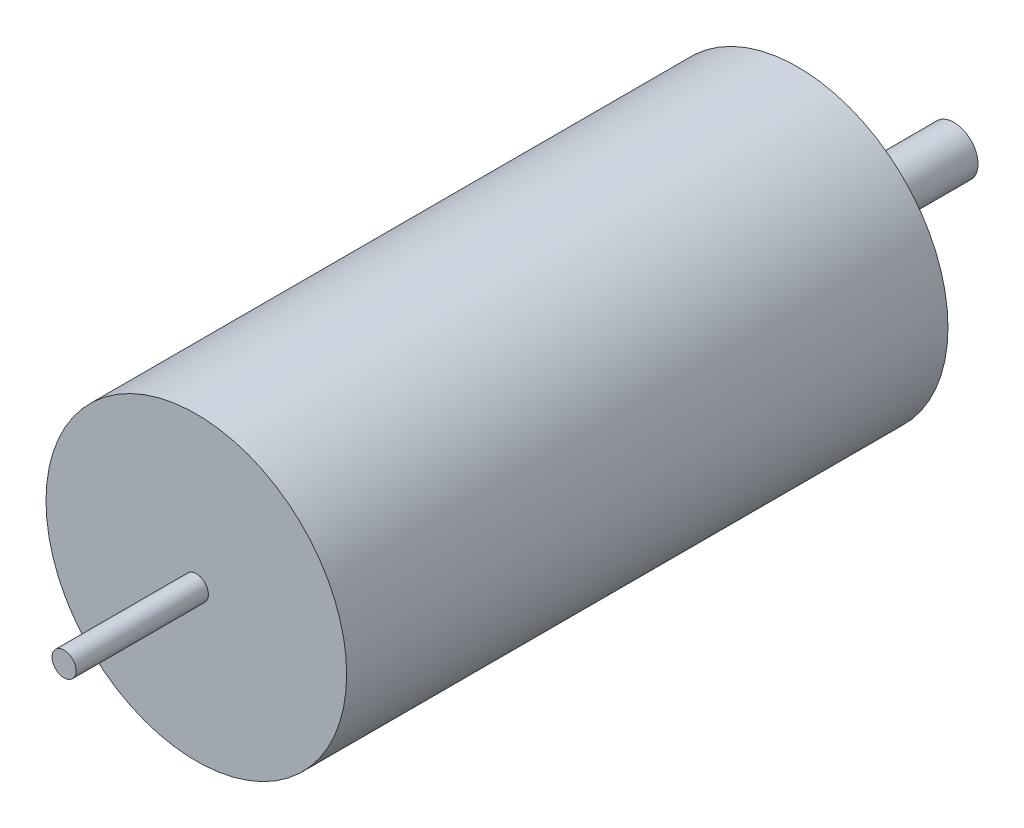
ISO-10303-21;
HEADER;
FILE_DESCRIPTION(('STEP AP214'),'2;1');
FILE_NAME('part.step','',(''),(''),'','','');
FILE_SCHEMA(('AUTOMOTIVE_DESIGN { 1 0 10303 214 1 1 1 1 }'));
ENDSEC;
DATA;
#1=APPLICATION_CONTEXT('core data for automotive mechanical design processes');
#2=APPLICATION_PROTOCOL_DEFINITION('international standard','automotive_design',2000,#1);
#3=PRODUCT_CONTEXT('',#1,'mechanical');
#4=PRODUCT('Part','Part','',(#3));
#5=PRODUCT_RELATED_PRODUCT_CATEGORY('part','',(#4));
#6=PRODUCT_DEFINITION_FORMATION('','',#4);
#7=PRODUCT_DEFINITION_CONTEXT('part definition',#1,'design');
#8=PRODUCT_DEFINITION('design','',#6,#7);
#9=PRODUCT_DEFINITION_SHAPE('','',#8);
#10=(LENGTH_UNIT() NAMED_UNIT(*) SI_UNIT(.MILLI.,.METRE.));
#11=(NAMED_UNIT(*) PLANE_ANGLE_UNIT() SI_UNIT($,.RADIAN.));
#12=(NAMED_UNIT(*) SI_UNIT($,.STERADIAN.) SOLID_ANGLE_UNIT());
#13=UNCERTAINTY_MEASURE_WITH_UNIT(LENGTH_MEASURE(1.E-05),#10,'distance_accuracy_value','');
#14=(GEOMETRIC_REPRESENTATION_CONTEXT(3) GLOBAL_UNCERTAINTY_ASSIGNED_CONTEXT((#13)) GLOBAL_UNIT_ASSIGNED_CONTEXT((#10,
#11,#12)) REPRESENTATION_CONTEXT('',''));
#15=CARTESIAN_POINT('',(0.,0.,0.));
#16=DIRECTION('',(0.,0.,1.));
#17=DIRECTION('',(1.,0.,0.));
#18=AXIS2_PLACEMENT_3D('',#15,#16,#17);
#19=CARTESIAN_POINT('',(0.,0.,50.));
#20=DIRECTION('',(0.,0.,-1.));
#21=DIRECTION('',(-1.,0.,0.));
#22=AXIS2_PLACEMENT_3D('',#19,#20,#21);
#23=CYLINDRICAL_SURFACE('',#22,12.5);
#24=CARTESIAN_POINT('',(0.,0.,50.));
#25=DIRECTION('',(0.,0.,1.));
#26=DIRECTION('',(1.,0.,0.));
#27=AXIS2_PLACEMENT_3D('',#24,#25,#26);
#28=CIRCLE('',#27,12.5);
#29=CARTESIAN_POINT('',(12.5,0.,50.));
#30=VERTEX_POINT('',#29);
#31=EDGE_CURVE('E48',#30,#30,#28,.T.);
#32=ORIENTED_EDGE('',*,*,#31,.F.);
#33=EDGE_LOOP('',(#32));
#34=FACE_BOUND('',#33,.T.);
#35=CARTESIAN_POINT('',(0.,0.,0.));
#36=DIRECTION('',(0.,0.,1.));
#37=DIRECTION('',(1.,0.,0.));
#38=AXIS2_PLACEMENT_3D('',#35,#36,#37);
#39=CIRCLE('',#38,12.5);
#40=CARTESIAN_POINT('',(12.5,0.,0.));
#41=VERTEX_POINT('',#40);
#42=EDGE_CURVE('E52',#41,#41,#39,.T.);
#43=ORIENTED_EDGE('',*,*,#42,.T.);
#44=EDGE_LOOP('',(#43));
#45=FACE_BOUND('',#44,.T.);
#46=ADVANCED_FACE('F42',(#34,#45),#23,.T.);
#47=CARTESIAN_POINT('',(0.,0.,50.));
#48=DIRECTION('',(0.,0.,1.));
#49=DIRECTION('',(1.,0.,0.));
#50=AXIS2_PLACEMENT_3D('',#47,#48,#49);
#51=PLANE('',#50);
#52=CARTESIAN_POINT('',(0.,0.,50.));
#53=DIRECTION('',(0.,0.,1.));
#54=DIRECTION('',(1.,0.,0.));
#55=AXIS2_PLACEMENT_3D('',#52,#53,#54);
#56=CIRCLE('',#55,1.);
#57=CARTESIAN_POINT('',(1.,0.,50.));
#58=VERTEX_POINT('',#57);
#59=EDGE_CURVE('E80',#58,#58,#56,.T.);
#60=ORIENTED_EDGE('',*,*,#59,.F.);
#61=EDGE_LOOP('',(#60));
#62=FACE_BOUND('',#61,.T.);
#63=ORIENTED_EDGE('',*,*,#31,.T.);
#64=EDGE_LOOP('',(#63));
#65=FACE_BOUND('',#64,.T.);
#66=ADVANCED_FACE('F95',(#62,#65),#51,.T.);
#67=CARTESIAN_POINT('',(0.,0.,0.));
#68=DIRECTION('',(0.,0.,1.));
#69=DIRECTION('',(1.,0.,0.));
#70=AXIS2_PLACEMENT_3D('',#67,#68,#69);
#71=PLANE('',#70);
#72=CARTESIAN_POINT('',(-8.5,0.,0.));
#73=DIRECTION('',(0.,0.,-1.));
#74=DIRECTION('',(1.,0.,0.));
#75=AXIS2_PLACEMENT_3D('',#72,#73,#74);
#76=CIRCLE('',#75,1.5);
#77=CARTESIAN_POINT('',(-7.,0.,0.));
#78=VERTEX_POINT('',#77);
#79=EDGE_CURVE('E74',#78,#78,#76,.T.);
#80=ORIENTED_EDGE('',*,*,#79,.F.);
#81=EDGE_LOOP('',(#80));
#82=FACE_BOUND('',#81,.T.);
#83=CARTESIAN_POINT('',(8.5,0.,0.));
#84=DIRECTION('',(0.,0.,-1.));
#85=DIRECTION('',(-1.,0.,0.));
#86=AXIS2_PLACEMENT_3D('',#83,#84,#85);
#87=CIRCLE('',#86,1.5);
#88=CARTESIAN_POINT('',(7.,0.,0.));
#89=VERTEX_POINT('',#88);
#90=EDGE_CURVE('E68',#89,#89,#87,.T.);
#91=ORIENTED_EDGE('',*,*,#90,.F.);
#92=EDGE_LOOP('',(#91));
#93=FACE_BOUND('',#92,.T.);
#94=CARTESIAN_POINT('',(0.,0.,0.));
#95=DIRECTION('',(0.,0.,1.));
#96=DIRECTION('',(1.,0.,0.));
#97=AXIS2_PLACEMENT_3D('',#94,#95,#96);
#98=CIRCLE('',#97,3.5);
#99=CARTESIAN_POINT('',(3.5,0.,0.));
#100=VERTEX_POINT('',#99);
#101=EDGE_CURVE('E12',#100,#100,#98,.F.);
#102=ORIENTED_EDGE('',*,*,#101,.F.);
#103=EDGE_LOOP('',(#102));
#104=FACE_BOUND('',#103,.T.);
#105=ORIENTED_EDGE('',*,*,#42,.F.);
#106=EDGE_LOOP('',(#105));
#107=FACE_BOUND('',#106,.T.);
#108=ADVANCED_FACE('F97',(#82,#93,#104,#107),#71,.F.);
#109=CARTESIAN_POINT('',(0.,0.,-2.));
#110=DIRECTION('',(0.,0.,1.));
#111=DIRECTION('',(1.,0.,0.));
#112=AXIS2_PLACEMENT_3D('',#109,#110,#111);
#113=CYLINDRICAL_SURFACE('',#112,3.5);
#114=CARTESIAN_POINT('',(0.,0.,-2.));
#115=DIRECTION('',(0.,0.,-1.));
#116=DIRECTION('',(-1.,0.,0.));
#117=AXIS2_PLACEMENT_3D('',#114,#115,#116);
#118=CIRCLE('',#117,3.5);
#119=CARTESIAN_POINT('',(-3.5,0.,-2.));
#120=VERTEX_POINT('',#119);
#121=EDGE_CURVE('E57',#120,#120,#118,.T.);
#122=ORIENTED_EDGE('',*,*,#121,.F.);
#123=EDGE_LOOP('',(#122));
#124=FACE_BOUND('',#123,.T.);
#125=ORIENTED_EDGE('',*,*,#101,.T.);
#126=EDGE_LOOP('',(#125));
#127=FACE_BOUND('',#126,.T.);
#128=ADVANCED_FACE('F103',(#124,#127),#113,.T.);
#129=CARTESIAN_POINT('',(0.,0.,-2.));
#130=DIRECTION('',(0.,0.,-1.));
#131=DIRECTION('',(-1.,0.,0.));
#132=AXIS2_PLACEMENT_3D('',#129,#130,#131);
#133=PLANE('',#132);
#134=CARTESIAN_POINT('',(0.,0.,-2.));
#135=DIRECTION('',(0.,0.,-1.));
#136=DIRECTION('',(-1.,0.,0.));
#137=AXIS2_PLACEMENT_3D('',#134,#135,#136);
#138=CIRCLE('',#137,2.);
#139=CARTESIAN_POINT('',(-2.,0.,-2.));
#140=VERTEX_POINT('',#139);
#141=EDGE_CURVE('E62',#140,#140,#138,.T.);
#142=ORIENTED_EDGE('',*,*,#141,.F.);
#143=EDGE_LOOP('',(#142));
#144=FACE_BOUND('',#143,.T.);
#145=ORIENTED_EDGE('',*,*,#121,.T.);
#146=EDGE_LOOP('',(#145));
#147=FACE_BOUND('',#146,.T.);
#148=ADVANCED_FACE('F109',(#144,#147),#133,.T.);
#149=CARTESIAN_POINT('',(0.,0.,-13.));
#150=DIRECTION('',(0.,0.,1.));
#151=DIRECTION('',(1.,0.,0.));
#152=AXIS2_PLACEMENT_3D('',#149,#150,#151);
#153=CYLINDRICAL_SURFACE('',#152,2.);
#154=CARTESIAN_POINT('',(0.,0.,-13.));
#155=DIRECTION('',(0.,0.,-1.));
#156=DIRECTION('',(-1.,0.,0.));
#157=AXIS2_PLACEMENT_3D('',#154,#155,#156);
#158=CIRCLE('',#157,2.);
#159=CARTESIAN_POINT('',(-2.,0.,-13.));
#160=VERTEX_POINT('',#159);
#161=EDGE_CURVE('E61',#160,#160,#158,.T.);
#162=ORIENTED_EDGE('',*,*,#161,.F.);
#163=EDGE_LOOP('',(#162));
#164=FACE_BOUND('',#163,.T.);
#165=ORIENTED_EDGE('',*,*,#141,.T.);
#166=EDGE_LOOP('',(#165));
#167=FACE_BOUND('',#166,.T.);
#168=ADVANCED_FACE('F113',(#164,#167),#153,.T.);
#169=CARTESIAN_POINT('',(0.,0.,-13.));
#170=DIRECTION('',(0.,0.,-1.));
#171=DIRECTION('',(-1.,0.,0.));
#172=AXIS2_PLACEMENT_3D('',#169,#170,#171);
#173=PLANE('',#172);
#174=ORIENTED_EDGE('',*,*,#161,.T.);
#175=EDGE_LOOP('',(#174));
#176=FACE_BOUND('',#175,.T.);
#177=ADVANCED_FACE('F117',(#176),#173,.T.);
#178=CARTESIAN_POINT('',(8.5,0.,5.));
#179=DIRECTION('',(0.,0.,-1.));
#180=DIRECTION('',(-1.,0.,0.));
#181=AXIS2_PLACEMENT_3D('',#178,#179,#180);
#182=CYLINDRICAL_SURFACE('',#181,1.5);
#183=CARTESIAN_POINT('',(8.5,0.,5.));
#184=DIRECTION('',(0.,0.,-1.));
#185=DIRECTION('',(-1.,0.,0.));
#186=AXIS2_PLACEMENT_3D('',#183,#184,#185);
#187=CIRCLE('',#186,1.5);
#188=CARTESIAN_POINT('',(7.,0.,5.));
#189=VERTEX_POINT('',#188);
#190=EDGE_CURVE('E65',#189,#189,#187,.T.);
#191=ORIENTED_EDGE('',*,*,#190,.F.);
#192=EDGE_LOOP('',(#191));
#193=FACE_BOUND('',#192,.T.);
#194=ORIENTED_EDGE('',*,*,#90,.T.);
#195=EDGE_LOOP('',(#194));
#196=FACE_BOUND('',#195,.T.);
#197=ADVANCED_FACE('F121',(#193,#196),#182,.F.);
#198=CARTESIAN_POINT('',(8.5,0.,5.));
#199=DIRECTION('',(0.,0.,-1.));
#200=DIRECTION('',(-1.,0.,0.));
#201=AXIS2_PLACEMENT_3D('',#198,#199,#200);
#202=PLANE('',#201);
#203=ORIENTED_EDGE('',*,*,#190,.T.);
#204=EDGE_LOOP('',(#203));
#205=FACE_BOUND('',#204,.T.);
#206=ADVANCED_FACE('F125',(#205),#202,.T.);
#207=CARTESIAN_POINT('',(-8.5,0.,5.));
#208=DIRECTION('',(0.,0.,-1.));
#209=DIRECTION('',(-1.,0.,0.));
#210=AXIS2_PLACEMENT_3D('',#207,#208,#209);
#211=CYLINDRICAL_SURFACE('',#210,1.5);
#212=CARTESIAN_POINT('',(-8.5,0.,5.));
#213=DIRECTION('',(0.,0.,-1.));
#214=DIRECTION('',(1.,0.,0.));
#215=AXIS2_PLACEMENT_3D('',#212,#213,#214);
#216=CIRCLE('',#215,1.5);
#217=CARTESIAN_POINT('',(-7.,0.,5.));
#218=VERTEX_POINT('',#217);
#219=EDGE_CURVE('E71',#218,#218,#216,.T.);
#220=ORIENTED_EDGE('',*,*,#219,.F.);
#221=EDGE_LOOP('',(#220));
#222=FACE_BOUND('',#221,.T.);
#223=ORIENTED_EDGE('',*,*,#79,.T.);
#224=EDGE_LOOP('',(#223));
#225=FACE_BOUND('',#224,.T.);
#226=ADVANCED_FACE('F129',(#222,#225),#211,.F.);
#227=CARTESIAN_POINT('',(-8.5,0.,5.));
#228=DIRECTION('',(0.,0.,1.));
#229=DIRECTION('',(1.,0.,0.));
#230=AXIS2_PLACEMENT_3D('',#227,#228,#229);
#231=PLANE('',#230);
#232=ORIENTED_EDGE('',*,*,#219,.T.);
#233=EDGE_LOOP('',(#232));
#234=FACE_BOUND('',#233,.T.);
#235=ADVANCED_FACE('F91',(#234),#231,.F.);
#236=CARTESIAN_POINT('',(0.,0.,61.));
#237=DIRECTION('',(0.,0.,-1.));
#238=DIRECTION('',(-1.,0.,0.));
#239=AXIS2_PLACEMENT_3D('',#236,#237,#238);
#240=CYLINDRICAL_SURFACE('',#239,1.);
#241=CARTESIAN_POINT('',(0.,0.,61.));
#242=DIRECTION('',(0.,0.,1.));
#243=DIRECTION('',(1.,0.,0.));
#244=AXIS2_PLACEMENT_3D('',#241,#242,#243);
#245=CIRCLE('',#244,1.);
#246=CARTESIAN_POINT('',(1.,0.,61.));
#247=VERTEX_POINT('',#246);
#248=EDGE_CURVE('E77',#247,#247,#245,.T.);
#249=ORIENTED_EDGE('',*,*,#248,.F.);
#250=EDGE_LOOP('',(#249));
#251=FACE_BOUND('',#250,.T.);
#252=ORIENTED_EDGE('',*,*,#59,.T.);
#253=EDGE_LOOP('',(#252));
#254=FACE_BOUND('',#253,.T.);
#255=ADVANCED_FACE('F88',(#251,#254),#240,.T.);
#256=CARTESIAN_POINT('',(0.,0.,61.));
#257=DIRECTION('',(0.,0.,1.));
#258=DIRECTION('',(1.,0.,0.));
#259=AXIS2_PLACEMENT_3D('',#256,#257,#258);
#260=PLANE('',#259);
#261=ORIENTED_EDGE('',*,*,#248,.T.);
#262=EDGE_LOOP('',(#261));
#263=FACE_BOUND('',#262,.T.);
#264=ADVANCED_FACE('F86',(#263),#260,.T.);
#265=CLOSED_SHELL('',(#46,#66,#108,#128,#148,#168,#177,#197,#206,#226,#235,#255,#264));
#266=MANIFOLD_SOLID_BREP('B2',#265);
#267=ADVANCED_BREP_SHAPE_REPRESENTATION('',(#18,#266),#14);
#268=SHAPE_DEFINITION_REPRESENTATION(#9,#267);
ENDSEC;
END-ISO-10303-21;
